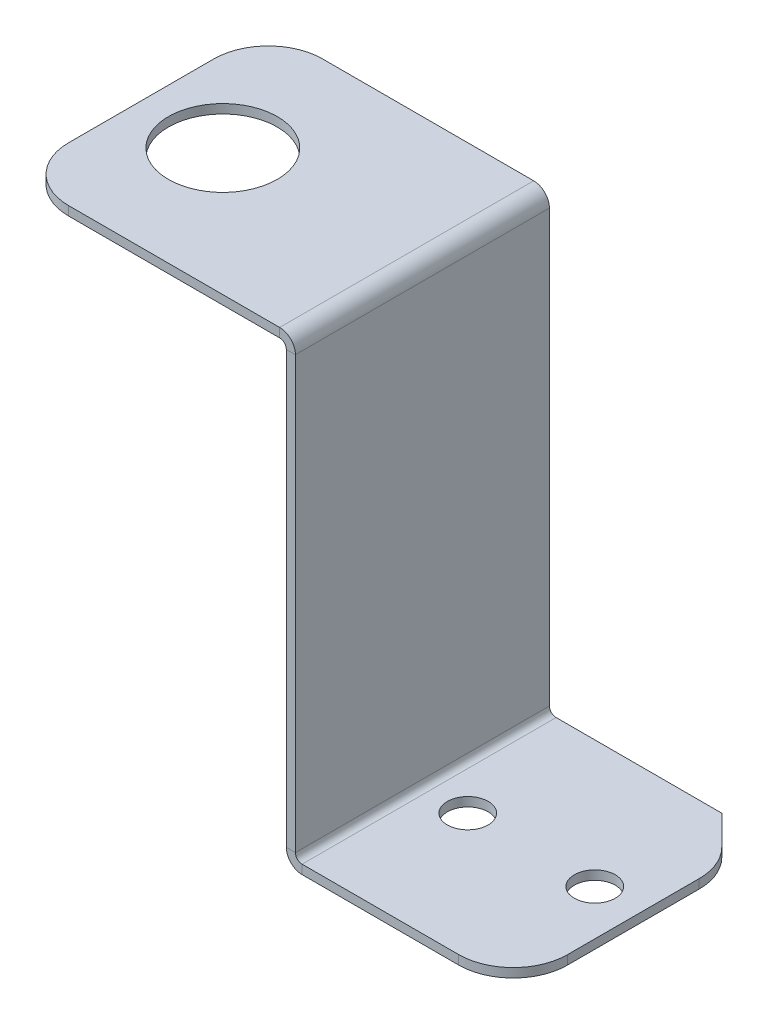
ISO-10303-21;
HEADER;
FILE_DESCRIPTION(('STEP AP214'),'2;1');
FILE_NAME('part.step','',(''),(''),'','','');
FILE_SCHEMA(('AUTOMOTIVE_DESIGN { 1 0 10303 214 1 1 1 1 }'));
ENDSEC;
DATA;
#1=APPLICATION_CONTEXT('core data for automotive mechanical design processes');
#2=APPLICATION_PROTOCOL_DEFINITION('international standard','automotive_design',2000,#1);
#3=PRODUCT_CONTEXT('',#1,'mechanical');
#4=PRODUCT('Part','Part','',(#3));
#5=PRODUCT_RELATED_PRODUCT_CATEGORY('part','',(#4));
#6=PRODUCT_DEFINITION_FORMATION('','',#4);
#7=PRODUCT_DEFINITION_CONTEXT('part definition',#1,'design');
#8=PRODUCT_DEFINITION('design','',#6,#7);
#9=PRODUCT_DEFINITION_SHAPE('','',#8);
#10=(LENGTH_UNIT() NAMED_UNIT(*) SI_UNIT(.MILLI.,.METRE.));
#11=(NAMED_UNIT(*) PLANE_ANGLE_UNIT() SI_UNIT($,.RADIAN.));
#12=(NAMED_UNIT(*) SI_UNIT($,.STERADIAN.) SOLID_ANGLE_UNIT());
#13=UNCERTAINTY_MEASURE_WITH_UNIT(LENGTH_MEASURE(1.E-05),#10,'distance_accuracy_value','');
#14=(GEOMETRIC_REPRESENTATION_CONTEXT(3) GLOBAL_UNCERTAINTY_ASSIGNED_CONTEXT((#13)) GLOBAL_UNIT_ASSIGNED_CONTEXT((#10,
#11,#12)) REPRESENTATION_CONTEXT('',''));
#15=CARTESIAN_POINT('',(0.,0.,0.));
#16=DIRECTION('',(0.,0.,1.));
#17=DIRECTION('',(1.,0.,0.));
#18=AXIS2_PLACEMENT_3D('',#15,#16,#17);
#19=CARTESIAN_POINT('',(-0.736600000000001,20.7619047619048,-28.));
#20=DIRECTION('',(0.,0.,-1.));
#21=DIRECTION('',(-1.,0.,0.));
#22=AXIS2_PLACEMENT_3D('',#19,#20,#21);
#23=PLANE('',#22);
#24=DIRECTION('',(0.,-1.,0.));
#25=VECTOR('',#24,1.);
#26=CARTESIAN_POINT('',(0.,19.7619047619048,-28.));
#27=LINE('',#26,#25);
#28=CARTESIAN_POINT('',(0.,19.0253047619048,-28.));
#29=VERTEX_POINT('',#28);
#30=CARTESIAN_POINT('',(0.,-28.5014952380952,-28.));
#31=VERTEX_POINT('',#30);
#32=EDGE_CURVE('E313',#29,#31,#27,.T.);
#33=ORIENTED_EDGE('',*,*,#32,.F.);
#34=DIRECTION('',(1.,0.,0.));
#35=VECTOR('',#34,1.);
#36=CARTESIAN_POINT('',(0.,19.0253047619048,-28.));
#37=LINE('',#36,#35);
#38=CARTESIAN_POINT('',(1.,19.0253047619048,-28.));
#39=VERTEX_POINT('',#38);
#40=EDGE_CURVE('E335',#29,#39,#37,.T.);
#41=ORIENTED_EDGE('',*,*,#40,.T.);
#42=DIRECTION('',(0.,-1.,0.));
#43=VECTOR('',#42,1.);
#44=CARTESIAN_POINT('',(1.,19.7619047619048,-28.));
#45=LINE('',#44,#43);
#46=CARTESIAN_POINT('',(1.00000000000001,-28.5014952380952,-28.));
#47=VERTEX_POINT('',#46);
#48=EDGE_CURVE('E310',#39,#47,#45,.T.);
#49=ORIENTED_EDGE('',*,*,#48,.T.);
#50=DIRECTION('',(-1.,0.,0.));
#51=VECTOR('',#50,1.);
#52=CARTESIAN_POINT('',(1.00000000000001,-28.5014952380952,-28.));
#53=LINE('',#52,#51);
#54=EDGE_CURVE('E329',#47,#31,#53,.T.);
#55=ORIENTED_EDGE('',*,*,#54,.T.);
#56=EDGE_LOOP('',(#33,#41,#49,#55));
#57=FACE_BOUND('',#56,.T.);
#58=ADVANCED_FACE('F39',(#57),#23,.T.);
#59=CARTESIAN_POINT('',(1.73660000000001,-29.2380952380952,0.));
#60=DIRECTION('',(0.,0.,1.));
#61=DIRECTION('',(1.,0.,0.));
#62=AXIS2_PLACEMENT_3D('',#59,#60,#61);
#63=PLANE('',#62);
#64=DIRECTION('',(0.,-1.,0.));
#65=VECTOR('',#64,1.);
#66=CARTESIAN_POINT('',(0.,19.7619047619048,0.));
#67=LINE('',#66,#65);
#68=CARTESIAN_POINT('',(0.,19.0253047619048,0.));
#69=VERTEX_POINT('',#68);
#70=CARTESIAN_POINT('',(0.,-28.5014952380952,0.));
#71=VERTEX_POINT('',#70);
#72=EDGE_CURVE('E314',#69,#71,#67,.T.);
#73=ORIENTED_EDGE('',*,*,#72,.T.);
#74=DIRECTION('',(1.,0.,0.));
#75=VECTOR('',#74,1.);
#76=CARTESIAN_POINT('',(0.,-28.5014952380952,0.));
#77=LINE('',#76,#75);
#78=CARTESIAN_POINT('',(1.00000000000001,-28.5014952380952,0.));
#79=VERTEX_POINT('',#78);
#80=EDGE_CURVE('E323',#71,#79,#77,.T.);
#81=ORIENTED_EDGE('',*,*,#80,.T.);
#82=DIRECTION('',(0.,-1.,0.));
#83=VECTOR('',#82,1.);
#84=CARTESIAN_POINT('',(1.,19.7619047619048,0.));
#85=LINE('',#84,#83);
#86=CARTESIAN_POINT('',(1.,19.0253047619048,0.));
#87=VERTEX_POINT('',#86);
#88=EDGE_CURVE('E306',#87,#79,#85,.T.);
#89=ORIENTED_EDGE('',*,*,#88,.F.);
#90=DIRECTION('',(-1.,0.,0.));
#91=VECTOR('',#90,1.);
#92=CARTESIAN_POINT('',(1.,19.0253047619048,0.));
#93=LINE('',#92,#91);
#94=EDGE_CURVE('E11',#87,#69,#93,.T.);
#95=ORIENTED_EDGE('',*,*,#94,.T.);
#96=EDGE_LOOP('',(#73,#81,#89,#95));
#97=FACE_BOUND('',#96,.T.);
#98=ADVANCED_FACE('F359',(#97),#63,.T.);
#99=CARTESIAN_POINT('',(0.,19.7619047619048,-28.));
#100=DIRECTION('',(-1.,0.,0.));
#101=DIRECTION('',(0.,-1.,0.));
#102=AXIS2_PLACEMENT_3D('',#99,#100,#101);
#103=PLANE('',#102);
#104=ORIENTED_EDGE('',*,*,#72,.F.);
#105=DIRECTION('',(0.,0.,1.));
#106=VECTOR('',#105,1.);
#107=CARTESIAN_POINT('',(0.,19.0253047619048,-28.));
#108=LINE('',#107,#106);
#109=EDGE_CURVE('E46',#29,#69,#108,.T.);
#110=ORIENTED_EDGE('',*,*,#109,.F.);
#111=ORIENTED_EDGE('',*,*,#32,.T.);
#112=DIRECTION('',(0.,0.,1.));
#113=VECTOR('',#112,1.);
#114=CARTESIAN_POINT('',(0.,-28.5014952380952,-28.));
#115=LINE('',#114,#113);
#116=EDGE_CURVE('E326',#31,#71,#115,.T.);
#117=ORIENTED_EDGE('',*,*,#116,.T.);
#118=EDGE_LOOP('',(#104,#110,#111,#117));
#119=FACE_BOUND('',#118,.T.);
#120=ADVANCED_FACE('F390',(#119),#103,.T.);
#121=CARTESIAN_POINT('',(1.,19.7619047619048,-28.));
#122=DIRECTION('',(-1.,0.,0.));
#123=DIRECTION('',(0.,-1.,0.));
#124=AXIS2_PLACEMENT_3D('',#121,#122,#123);
#125=PLANE('',#124);
#126=ORIENTED_EDGE('',*,*,#88,.T.);
#127=DIRECTION('',(0.,0.,1.));
#128=VECTOR('',#127,1.);
#129=CARTESIAN_POINT('',(1.00000000000001,-28.5014952380952,-28.));
#130=LINE('',#129,#128);
#131=EDGE_CURVE('E317',#47,#79,#130,.T.);
#132=ORIENTED_EDGE('',*,*,#131,.F.);
#133=ORIENTED_EDGE('',*,*,#48,.F.);
#134=DIRECTION('',(0.,0.,1.));
#135=VECTOR('',#134,1.);
#136=CARTESIAN_POINT('',(1.,19.0253047619048,-28.));
#137=LINE('',#136,#135);
#138=EDGE_CURVE('E332',#39,#87,#137,.T.);
#139=ORIENTED_EDGE('',*,*,#138,.T.);
#140=EDGE_LOOP('',(#126,#132,#133,#139));
#141=FACE_BOUND('',#140,.T.);
#142=ADVANCED_FACE('F361',(#141),#125,.F.);
#143=CARTESIAN_POINT('',(1.73660000000001,-28.5014952380952,-28.));
#144=DIRECTION('',(0.,0.,1.));
#145=DIRECTION('',(1.,0.,0.));
#146=AXIS2_PLACEMENT_3D('',#143,#144,#145);
#147=PLANE('',#146);
#148=DIRECTION('',(0.,1.,0.));
#149=VECTOR('',#148,1.);
#150=CARTESIAN_POINT('',(1.7366,-30.2380952380952,-28.));
#151=LINE('',#150,#149);
#152=CARTESIAN_POINT('',(1.7366,-30.2380952380952,-28.));
#153=VERTEX_POINT('',#152);
#154=CARTESIAN_POINT('',(1.7366,-29.2380952380952,-28.));
#155=VERTEX_POINT('',#154);
#156=EDGE_CURVE('E232',#153,#155,#151,.T.);
#157=ORIENTED_EDGE('',*,*,#156,.F.);
#158=CARTESIAN_POINT('',(1.73660000000001,-28.5014952380952,-28.));
#159=DIRECTION('',(0.,0.,-1.));
#160=DIRECTION('',(-1.,0.,0.));
#161=AXIS2_PLACEMENT_3D('',#158,#159,#160);
#162=CIRCLE('',#161,1.7366);
#163=EDGE_CURVE('E60',#153,#31,#162,.T.);
#164=ORIENTED_EDGE('',*,*,#163,.T.);
#165=ORIENTED_EDGE('',*,*,#54,.F.);
#166=CARTESIAN_POINT('',(1.73660000000001,-28.5014952380952,-28.));
#167=DIRECTION('',(0.,0.,-1.));
#168=DIRECTION('',(-1.,0.,0.));
#169=AXIS2_PLACEMENT_3D('',#166,#167,#168);
#170=CIRCLE('',#169,0.7366);
#171=EDGE_CURVE('E299',#155,#47,#170,.T.);
#172=ORIENTED_EDGE('',*,*,#171,.F.);
#173=EDGE_LOOP('',(#157,#164,#165,#172));
#174=FACE_BOUND('',#173,.T.);
#175=ADVANCED_FACE('F382',(#174),#147,.F.);
#176=CARTESIAN_POINT('',(1.73660000000001,-28.5014952380952,0.));
#177=DIRECTION('',(0.,0.,-1.));
#178=DIRECTION('',(0.,1.,0.));
#179=AXIS2_PLACEMENT_3D('',#176,#177,#178);
#180=PLANE('',#179);
#181=ORIENTED_EDGE('',*,*,#80,.F.);
#182=CARTESIAN_POINT('',(1.73660000000001,-28.5014952380952,0.));
#183=DIRECTION('',(0.,0.,-1.));
#184=DIRECTION('',(-1.,0.,0.));
#185=AXIS2_PLACEMENT_3D('',#182,#183,#184);
#186=CIRCLE('',#185,1.7366);
#187=CARTESIAN_POINT('',(1.7366,-30.2380952380952,0.));
#188=VERTEX_POINT('',#187);
#189=EDGE_CURVE('E303',#71,#188,#186,.F.);
#190=ORIENTED_EDGE('',*,*,#189,.T.);
#191=DIRECTION('',(0.,-1.,0.));
#192=VECTOR('',#191,1.);
#193=CARTESIAN_POINT('',(1.7366,-29.2380952380952,0.));
#194=LINE('',#193,#192);
#195=CARTESIAN_POINT('',(1.73660000000001,-29.2380952380952,0.));
#196=VERTEX_POINT('',#195);
#197=EDGE_CURVE('E254',#196,#188,#194,.T.);
#198=ORIENTED_EDGE('',*,*,#197,.F.);
#199=CARTESIAN_POINT('',(1.73660000000001,-28.5014952380952,0.));
#200=DIRECTION('',(0.,0.,1.));
#201=DIRECTION('',(0.,-1.,0.));
#202=AXIS2_PLACEMENT_3D('',#199,#200,#201);
#203=CIRCLE('',#202,0.7366);
#204=EDGE_CURVE('E302',#79,#196,#203,.T.);
#205=ORIENTED_EDGE('',*,*,#204,.F.);
#206=EDGE_LOOP('',(#181,#190,#198,#205));
#207=FACE_BOUND('',#206,.T.);
#208=ADVANCED_FACE('F369',(#207),#180,.F.);
#209=CARTESIAN_POINT('',(1.73660000000001,-28.5014952380952,14.0851045810561));
#210=DIRECTION('',(0.,0.,-1.));
#211=DIRECTION('',(-1.,0.,0.));
#212=AXIS2_PLACEMENT_3D('',#209,#210,#211);
#213=CYLINDRICAL_SURFACE('',#212,0.7366);
#214=ORIENTED_EDGE('',*,*,#204,.T.);
#215=DIRECTION('',(0.,0.,1.));
#216=VECTOR('',#215,1.);
#217=CARTESIAN_POINT('',(1.7366,-29.2380952380952,-28.));
#218=LINE('',#217,#216);
#219=EDGE_CURVE('E262',#155,#196,#218,.T.);
#220=ORIENTED_EDGE('',*,*,#219,.F.);
#221=ORIENTED_EDGE('',*,*,#171,.T.);
#222=ORIENTED_EDGE('',*,*,#131,.T.);
#223=EDGE_LOOP('',(#214,#220,#221,#222));
#224=FACE_BOUND('',#223,.T.);
#225=ADVANCED_FACE('F364',(#224),#213,.F.);
#226=CARTESIAN_POINT('',(1.73660000000001,-28.5014952380952,14.0851045810561));
#227=DIRECTION('',(0.,0.,-1.));
#228=DIRECTION('',(-1.,0.,0.));
#229=AXIS2_PLACEMENT_3D('',#226,#227,#228);
#230=CYLINDRICAL_SURFACE('',#229,1.7366);
#231=ORIENTED_EDGE('',*,*,#189,.F.);
#232=ORIENTED_EDGE('',*,*,#116,.F.);
#233=ORIENTED_EDGE('',*,*,#163,.F.);
#234=DIRECTION('',(0.,0.,1.));
#235=VECTOR('',#234,1.);
#236=CARTESIAN_POINT('',(1.7366,-30.2380952380952,-28.));
#237=LINE('',#236,#235);
#238=EDGE_CURVE('E227',#153,#188,#237,.T.);
#239=ORIENTED_EDGE('',*,*,#238,.T.);
#240=EDGE_LOOP('',(#231,#232,#233,#239));
#241=FACE_BOUND('',#240,.T.);
#242=ADVANCED_FACE('F404',(#241),#230,.T.);
#243=CARTESIAN_POINT('',(20.,-28.5014952380952,-28.));
#244=DIRECTION('',(0.707106781186549,0.,-0.707106781186547));
#245=DIRECTION('',(0.,1.,0.));
#246=AXIS2_PLACEMENT_3D('',#243,#244,#245);
#247=PLANE('',#246);
#248=DIRECTION('',(-0.707106781186547,0.,-0.707106781186549));
#249=VECTOR('',#248,1.);
#250=CARTESIAN_POINT('',(20.,-29.2380952380952,-28.));
#251=LINE('',#250,#249);
#252=CARTESIAN_POINT('',(23.2426406871193,-29.2380952380952,-24.7573593128807));
#253=VERTEX_POINT('',#252);
#254=CARTESIAN_POINT('',(20.,-29.2380952380952,-28.));
#255=VERTEX_POINT('',#254);
#256=EDGE_CURVE('E265',#253,#255,#251,.T.);
#257=ORIENTED_EDGE('',*,*,#256,.F.);
#258=DIRECTION('',(0.,1.,0.));
#259=VECTOR('',#258,1.);
#260=CARTESIAN_POINT('',(23.2426406871193,-30.2380952380952,-24.7573593128807));
#261=LINE('',#260,#259);
#262=CARTESIAN_POINT('',(23.2426406871193,-30.2380952380952,-24.7573593128807));
#263=VERTEX_POINT('',#262);
#264=EDGE_CURVE('E295',#253,#263,#261,.F.);
#265=ORIENTED_EDGE('',*,*,#264,.T.);
#266=DIRECTION('',(0.707106781186547,0.,0.707106781186549));
#267=VECTOR('',#266,1.);
#268=CARTESIAN_POINT('',(10.,-30.2380952380952,-38.));
#269=LINE('',#268,#267);
#270=CARTESIAN_POINT('',(20.,-30.2380952380952,-28.));
#271=VERTEX_POINT('',#270);
#272=EDGE_CURVE('E243',#271,#263,#269,.T.);
#273=ORIENTED_EDGE('',*,*,#272,.F.);
#274=DIRECTION('',(0.,-1.,0.));
#275=VECTOR('',#274,1.);
#276=CARTESIAN_POINT('',(20.,-30.2380952380952,-28.));
#277=LINE('',#276,#275);
#278=EDGE_CURVE('E235',#255,#271,#277,.T.);
#279=ORIENTED_EDGE('',*,*,#278,.F.);
#280=EDGE_LOOP('',(#257,#265,#273,#279));
#281=FACE_BOUND('',#280,.T.);
#282=ADVANCED_FACE('F418',(#281),#247,.T.);
#283=CARTESIAN_POINT('',(19.,-29.2380952380952,-20.5147186257614));
#284=DIRECTION('',(0.,-1.,0.));
#285=DIRECTION('',(0.,0.,-1.));
#286=AXIS2_PLACEMENT_3D('',#283,#284,#285);
#287=CYLINDRICAL_SURFACE('',#286,6.);
#288=CARTESIAN_POINT('',(19.,-30.2380952380952,-20.5147186257614));
#289=DIRECTION('',(0.,-1.,0.));
#290=DIRECTION('',(0.,0.,-1.));
#291=AXIS2_PLACEMENT_3D('',#288,#289,#290);
#292=CIRCLE('',#291,6.);
#293=CARTESIAN_POINT('',(25.,-30.2380952380952,-20.5147186257614));
#294=VERTEX_POINT('',#293);
#295=EDGE_CURVE('E241',#263,#294,#292,.T.);
#296=ORIENTED_EDGE('',*,*,#295,.F.);
#297=ORIENTED_EDGE('',*,*,#264,.F.);
#298=CARTESIAN_POINT('',(19.,-29.2380952380952,-20.5147186257614));
#299=DIRECTION('',(0.,-1.,0.));
#300=DIRECTION('',(0.,0.,-1.));
#301=AXIS2_PLACEMENT_3D('',#298,#299,#300);
#302=CIRCLE('',#301,6.);
#303=CARTESIAN_POINT('',(25.,-29.2380952380952,-20.5147186257614));
#304=VERTEX_POINT('',#303);
#305=EDGE_CURVE('E267',#304,#253,#302,.F.);
#306=ORIENTED_EDGE('',*,*,#305,.F.);
#307=DIRECTION('',(0.,1.,0.));
#308=VECTOR('',#307,1.);
#309=CARTESIAN_POINT('',(25.,-29.2380952380952,-20.5147186257614));
#310=LINE('',#309,#308);
#311=EDGE_CURVE('E286',#294,#304,#310,.T.);
#312=ORIENTED_EDGE('',*,*,#311,.F.);
#313=EDGE_LOOP('',(#296,#297,#306,#312));
#314=FACE_BOUND('',#313,.T.);
#315=ADVANCED_FACE('F420',(#314),#287,.T.);
#316=CARTESIAN_POINT('',(25.,-29.2380952380952,-28.));
#317=DIRECTION('',(-1.,0.,0.));
#318=DIRECTION('',(0.,0.,1.));
#319=AXIS2_PLACEMENT_3D('',#316,#317,#318);
#320=PLANE('',#319);
#321=DIRECTION('',(0.,0.,1.));
#322=VECTOR('',#321,1.);
#323=CARTESIAN_POINT('',(25.,-29.2380952380952,-28.));
#324=LINE('',#323,#322);
#325=CARTESIAN_POINT('',(25.,-29.2380952380952,-6.));
#326=VERTEX_POINT('',#325);
#327=EDGE_CURVE('E292',#304,#326,#324,.T.);
#328=ORIENTED_EDGE('',*,*,#327,.T.);
#329=DIRECTION('',(0.,-1.,0.));
#330=VECTOR('',#329,1.);
#331=CARTESIAN_POINT('',(25.,-30.2380952380952,-6.));
#332=LINE('',#331,#330);
#333=CARTESIAN_POINT('',(25.,-30.2380952380952,-6.));
#334=VERTEX_POINT('',#333);
#335=EDGE_CURVE('E289',#326,#334,#332,.T.);
#336=ORIENTED_EDGE('',*,*,#335,.T.);
#337=DIRECTION('',(0.,0.,1.));
#338=VECTOR('',#337,1.);
#339=CARTESIAN_POINT('',(25.,-30.2380952380952,-28.));
#340=LINE('',#339,#338);
#341=EDGE_CURVE('E251',#294,#334,#340,.T.);
#342=ORIENTED_EDGE('',*,*,#341,.F.);
#343=ORIENTED_EDGE('',*,*,#311,.T.);
#344=EDGE_LOOP('',(#328,#336,#342,#343));
#345=FACE_BOUND('',#344,.T.);
#346=ADVANCED_FACE('F412',(#345),#320,.F.);
#347=CARTESIAN_POINT('',(19.,-29.2380952380952,-6.));
#348=DIRECTION('',(0.,1.,0.));
#349=DIRECTION('',(0.,0.,1.));
#350=AXIS2_PLACEMENT_3D('',#347,#348,#349);
#351=CYLINDRICAL_SURFACE('',#350,6.);
#352=CARTESIAN_POINT('',(19.,-29.2380952380952,-6.));
#353=DIRECTION('',(0.,-1.,0.));
#354=DIRECTION('',(0.,0.,-1.));
#355=AXIS2_PLACEMENT_3D('',#352,#353,#354);
#356=CIRCLE('',#355,6.);
#357=CARTESIAN_POINT('',(19.,-29.2380952380952,0.));
#358=VERTEX_POINT('',#357);
#359=EDGE_CURVE('E269',#358,#326,#356,.F.);
#360=ORIENTED_EDGE('',*,*,#359,.F.);
#361=DIRECTION('',(0.,-1.,0.));
#362=VECTOR('',#361,1.);
#363=CARTESIAN_POINT('',(19.,-29.2380952380952,0.));
#364=LINE('',#363,#362);
#365=CARTESIAN_POINT('',(19.,-30.2380952380952,0.));
#366=VERTEX_POINT('',#365);
#367=EDGE_CURVE('E257',#366,#358,#364,.F.);
#368=ORIENTED_EDGE('',*,*,#367,.F.);
#369=CARTESIAN_POINT('',(19.,-30.2380952380952,-6.));
#370=DIRECTION('',(0.,-1.,0.));
#371=DIRECTION('',(0.,0.,-1.));
#372=AXIS2_PLACEMENT_3D('',#369,#370,#371);
#373=CIRCLE('',#372,6.);
#374=EDGE_CURVE('E249',#334,#366,#373,.T.);
#375=ORIENTED_EDGE('',*,*,#374,.F.);
#376=ORIENTED_EDGE('',*,*,#335,.F.);
#377=EDGE_LOOP('',(#360,#368,#375,#376));
#378=FACE_BOUND('',#377,.T.);
#379=ADVANCED_FACE('F410',(#378),#351,.T.);
#380=CARTESIAN_POINT('',(6.00000000000001,-30.2380952380952,-14.));
#381=DIRECTION('',(0.,-1.,0.));
#382=DIRECTION('',(0.,0.,-1.));
#383=AXIS2_PLACEMENT_3D('',#380,#381,#382);
#384=CYLINDRICAL_SURFACE('',#383,2.25);
#385=CARTESIAN_POINT('',(6.00000000000001,-30.2380952380952,-14.));
#386=DIRECTION('',(0.,-1.,0.));
#387=DIRECTION('',(0.,0.,-1.));
#388=AXIS2_PLACEMENT_3D('',#385,#386,#387);
#389=CIRCLE('',#388,2.25);
#390=CARTESIAN_POINT('',(6.00000000000001,-30.2380952380952,-16.25));
#391=VERTEX_POINT('',#390);
#392=EDGE_CURVE('E283',#391,#391,#389,.T.);
#393=ORIENTED_EDGE('',*,*,#392,.T.);
#394=EDGE_LOOP('',(#393));
#395=FACE_BOUND('',#394,.T.);
#396=CARTESIAN_POINT('',(6.00000000000001,-29.2380952380952,-14.));
#397=DIRECTION('',(0.,-1.,0.));
#398=DIRECTION('',(0.,0.,-1.));
#399=AXIS2_PLACEMENT_3D('',#396,#397,#398);
#400=CIRCLE('',#399,2.25);
#401=CARTESIAN_POINT('',(6.00000000000001,-29.2380952380952,-16.25));
#402=VERTEX_POINT('',#401);
#403=EDGE_CURVE('E274',#402,#402,#400,.T.);
#404=ORIENTED_EDGE('',*,*,#403,.F.);
#405=EDGE_LOOP('',(#404));
#406=FACE_BOUND('',#405,.T.);
#407=ADVANCED_FACE('F433',(#395,#406),#384,.F.);
#408=CARTESIAN_POINT('',(20.,-30.2380952380952,-14.));
#409=DIRECTION('',(0.,-1.,0.));
#410=DIRECTION('',(0.,0.,-1.));
#411=AXIS2_PLACEMENT_3D('',#408,#409,#410);
#412=CYLINDRICAL_SURFACE('',#411,2.25);
#413=CARTESIAN_POINT('',(20.,-30.2380952380952,-14.));
#414=DIRECTION('',(0.,-1.,0.));
#415=DIRECTION('',(0.,0.,-1.));
#416=AXIS2_PLACEMENT_3D('',#413,#414,#415);
#417=CIRCLE('',#416,2.25);
#418=CARTESIAN_POINT('',(20.,-30.2380952380952,-16.25));
#419=VERTEX_POINT('',#418);
#420=EDGE_CURVE('E280',#419,#419,#417,.T.);
#421=ORIENTED_EDGE('',*,*,#420,.T.);
#422=EDGE_LOOP('',(#421));
#423=FACE_BOUND('',#422,.T.);
#424=CARTESIAN_POINT('',(20.,-29.2380952380952,-14.));
#425=DIRECTION('',(0.,-1.,0.));
#426=DIRECTION('',(0.,0.,-1.));
#427=AXIS2_PLACEMENT_3D('',#424,#425,#426);
#428=CIRCLE('',#427,2.25);
#429=CARTESIAN_POINT('',(20.,-29.2380952380952,-16.25));
#430=VERTEX_POINT('',#429);
#431=EDGE_CURVE('E277',#430,#430,#428,.T.);
#432=ORIENTED_EDGE('',*,*,#431,.F.);
#433=EDGE_LOOP('',(#432));
#434=FACE_BOUND('',#433,.T.);
#435=ADVANCED_FACE('F436',(#423,#434),#412,.F.);
#436=CARTESIAN_POINT('',(0.,-29.2380952380952,-28.));
#437=DIRECTION('',(0.,-1.,0.));
#438=DIRECTION('',(0.,0.,-1.));
#439=AXIS2_PLACEMENT_3D('',#436,#437,#438);
#440=PLANE('',#439);
#441=ORIENTED_EDGE('',*,*,#431,.T.);
#442=EDGE_LOOP('',(#441));
#443=FACE_BOUND('',#442,.T.);
#444=ORIENTED_EDGE('',*,*,#403,.T.);
#445=EDGE_LOOP('',(#444));
#446=FACE_BOUND('',#445,.T.);
#447=DIRECTION('',(1.,0.,0.));
#448=VECTOR('',#447,1.);
#449=CARTESIAN_POINT('',(0.,-29.2380952380952,0.));
#450=LINE('',#449,#448);
#451=EDGE_CURVE('E271',#196,#358,#450,.T.);
#452=ORIENTED_EDGE('',*,*,#451,.T.);
#453=ORIENTED_EDGE('',*,*,#359,.T.);
#454=ORIENTED_EDGE('',*,*,#327,.F.);
#455=ORIENTED_EDGE('',*,*,#305,.T.);
#456=ORIENTED_EDGE('',*,*,#256,.T.);
#457=DIRECTION('',(1.,0.,0.));
#458=VECTOR('',#457,1.);
#459=CARTESIAN_POINT('',(0.,-29.2380952380952,-28.));
#460=LINE('',#459,#458);
#461=EDGE_CURVE('E238',#155,#255,#460,.T.);
#462=ORIENTED_EDGE('',*,*,#461,.F.);
#463=ORIENTED_EDGE('',*,*,#219,.T.);
#464=EDGE_LOOP('',(#452,#453,#454,#455,#456,#462,#463));
#465=FACE_BOUND('',#464,.T.);
#466=ADVANCED_FACE('F376',(#443,#446,#465),#440,.F.);
#467=CARTESIAN_POINT('',(1.7366,-28.5014952380952,0.));
#468=DIRECTION('',(0.,0.,1.));
#469=DIRECTION('',(1.,0.,0.));
#470=AXIS2_PLACEMENT_3D('',#467,#468,#469);
#471=PLANE('',#470);
#472=DIRECTION('',(1.,0.,0.));
#473=VECTOR('',#472,1.);
#474=CARTESIAN_POINT('',(0.,-30.2380952380952,0.));
#475=LINE('',#474,#473);
#476=EDGE_CURVE('E259',#188,#366,#475,.T.);
#477=ORIENTED_EDGE('',*,*,#476,.T.);
#478=ORIENTED_EDGE('',*,*,#367,.T.);
#479=ORIENTED_EDGE('',*,*,#451,.F.);
#480=ORIENTED_EDGE('',*,*,#197,.T.);
#481=EDGE_LOOP('',(#477,#478,#479,#480));
#482=FACE_BOUND('',#481,.T.);
#483=ADVANCED_FACE('F372',(#482),#471,.T.);
#484=CARTESIAN_POINT('',(0.,-30.2380952380952,-28.));
#485=DIRECTION('',(0.,-1.,0.));
#486=DIRECTION('',(0.,0.,-1.));
#487=AXIS2_PLACEMENT_3D('',#484,#485,#486);
#488=PLANE('',#487);
#489=ORIENTED_EDGE('',*,*,#420,.F.);
#490=EDGE_LOOP('',(#489));
#491=FACE_BOUND('',#490,.T.);
#492=ORIENTED_EDGE('',*,*,#392,.F.);
#493=EDGE_LOOP('',(#492));
#494=FACE_BOUND('',#493,.T.);
#495=ORIENTED_EDGE('',*,*,#341,.T.);
#496=ORIENTED_EDGE('',*,*,#374,.T.);
#497=ORIENTED_EDGE('',*,*,#476,.F.);
#498=ORIENTED_EDGE('',*,*,#238,.F.);
#499=DIRECTION('',(1.,0.,0.));
#500=VECTOR('',#499,1.);
#501=CARTESIAN_POINT('',(0.,-30.2380952380952,-28.));
#502=LINE('',#501,#500);
#503=EDGE_CURVE('E246',#153,#271,#502,.T.);
#504=ORIENTED_EDGE('',*,*,#503,.T.);
#505=ORIENTED_EDGE('',*,*,#272,.T.);
#506=ORIENTED_EDGE('',*,*,#295,.T.);
#507=EDGE_LOOP('',(#495,#496,#497,#498,#504,#505,#506));
#508=FACE_BOUND('',#507,.T.);
#509=ADVANCED_FACE('F406',(#491,#494,#508),#488,.T.);
#510=CARTESIAN_POINT('',(1.,-28.5014952380952,-28.));
#511=DIRECTION('',(0.,0.,-1.));
#512=DIRECTION('',(-1.,0.,0.));
#513=AXIS2_PLACEMENT_3D('',#510,#511,#512);
#514=PLANE('',#513);
#515=ORIENTED_EDGE('',*,*,#461,.T.);
#516=ORIENTED_EDGE('',*,*,#278,.T.);
#517=ORIENTED_EDGE('',*,*,#503,.F.);
#518=ORIENTED_EDGE('',*,*,#156,.T.);
#519=EDGE_LOOP('',(#515,#516,#517,#518));
#520=FACE_BOUND('',#519,.T.);
#521=ADVANCED_FACE('F380',(#520),#514,.T.);
#522=CARTESIAN_POINT('',(-0.7366,19.0253047619048,-28.));
#523=DIRECTION('',(0.,0.,-1.));
#524=DIRECTION('',(-1.,0.,0.));
#525=AXIS2_PLACEMENT_3D('',#522,#523,#524);
#526=PLANE('',#525);
#527=ORIENTED_EDGE('',*,*,#40,.F.);
#528=CARTESIAN_POINT('',(-0.7366,19.0253047619048,-28.));
#529=DIRECTION('',(0.,0.,1.));
#530=DIRECTION('',(1.,0.,0.));
#531=AXIS2_PLACEMENT_3D('',#528,#529,#530);
#532=CIRCLE('',#531,0.7366);
#533=CARTESIAN_POINT('',(-0.7366,19.7619047619048,-28.));
#534=VERTEX_POINT('',#533);
#535=EDGE_CURVE('E229',#29,#534,#532,.T.);
#536=ORIENTED_EDGE('',*,*,#535,.T.);
#537=DIRECTION('',(0.,-1.,0.));
#538=VECTOR('',#537,1.);
#539=CARTESIAN_POINT('',(-0.7366,20.7619047619048,-28.));
#540=LINE('',#539,#538);
#541=CARTESIAN_POINT('',(-0.736600000000004,20.7619047619048,-28.));
#542=VERTEX_POINT('',#541);
#543=EDGE_CURVE('E189',#542,#534,#540,.T.);
#544=ORIENTED_EDGE('',*,*,#543,.F.);
#545=CARTESIAN_POINT('',(-0.7366,19.0253047619048,-28.));
#546=DIRECTION('',(0.,0.,1.));
#547=DIRECTION('',(1.,0.,0.));
#548=AXIS2_PLACEMENT_3D('',#545,#546,#547);
#549=CIRCLE('',#548,1.7366);
#550=EDGE_CURVE('E220',#39,#542,#549,.T.);
#551=ORIENTED_EDGE('',*,*,#550,.F.);
#552=EDGE_LOOP('',(#527,#536,#544,#551));
#553=FACE_BOUND('',#552,.T.);
#554=ADVANCED_FACE('F342',(#553),#526,.T.);
#555=CARTESIAN_POINT('',(-0.7366,19.0253047619048,0.));
#556=DIRECTION('',(0.,0.,1.));
#557=DIRECTION('',(1.,0.,0.));
#558=AXIS2_PLACEMENT_3D('',#555,#556,#557);
#559=PLANE('',#558);
#560=DIRECTION('',(0.,1.,0.));
#561=VECTOR('',#560,1.);
#562=CARTESIAN_POINT('',(-0.7366,19.7619047619048,0.));
#563=LINE('',#562,#561);
#564=CARTESIAN_POINT('',(-0.7366,19.7619047619048,0.));
#565=VERTEX_POINT('',#564);
#566=CARTESIAN_POINT('',(-0.736600000000002,20.7619047619048,0.));
#567=VERTEX_POINT('',#566);
#568=EDGE_CURVE('E177',#565,#567,#563,.T.);
#569=ORIENTED_EDGE('',*,*,#568,.F.);
#570=CARTESIAN_POINT('',(-0.7366,19.0253047619048,0.));
#571=DIRECTION('',(0.,0.,1.));
#572=DIRECTION('',(1.,0.,0.));
#573=AXIS2_PLACEMENT_3D('',#570,#571,#572);
#574=CIRCLE('',#573,0.7366);
#575=EDGE_CURVE('E224',#565,#69,#574,.F.);
#576=ORIENTED_EDGE('',*,*,#575,.T.);
#577=ORIENTED_EDGE('',*,*,#94,.F.);
#578=CARTESIAN_POINT('',(-0.7366,19.0253047619048,0.));
#579=DIRECTION('',(0.,0.,-1.));
#580=DIRECTION('',(-1.,0.,0.));
#581=AXIS2_PLACEMENT_3D('',#578,#579,#580);
#582=CIRCLE('',#581,1.7366);
#583=EDGE_CURVE('E223',#567,#87,#582,.T.);
#584=ORIENTED_EDGE('',*,*,#583,.F.);
#585=EDGE_LOOP('',(#569,#576,#577,#584));
#586=FACE_BOUND('',#585,.T.);
#587=ADVANCED_FACE('F355',(#586),#559,.T.);
#588=CARTESIAN_POINT('',(-0.7366,19.0253047619048,-42.0851045810561));
#589=DIRECTION('',(0.,0.,1.));
#590=DIRECTION('',(1.,0.,0.));
#591=AXIS2_PLACEMENT_3D('',#588,#589,#590);
#592=CYLINDRICAL_SURFACE('',#591,1.7366);
#593=ORIENTED_EDGE('',*,*,#583,.T.);
#594=ORIENTED_EDGE('',*,*,#138,.F.);
#595=ORIENTED_EDGE('',*,*,#550,.T.);
#596=DIRECTION('',(0.,0.,1.));
#597=VECTOR('',#596,1.);
#598=CARTESIAN_POINT('',(-0.7366,20.7619047619048,-28.));
#599=LINE('',#598,#597);
#600=EDGE_CURVE('E217',#542,#567,#599,.T.);
#601=ORIENTED_EDGE('',*,*,#600,.T.);
#602=EDGE_LOOP('',(#593,#594,#595,#601));
#603=FACE_BOUND('',#602,.T.);
#604=ADVANCED_FACE('F354',(#603),#592,.T.);
#605=CARTESIAN_POINT('',(-0.7366,19.0253047619048,-42.0851045810561));
#606=DIRECTION('',(0.,0.,1.));
#607=DIRECTION('',(1.,0.,0.));
#608=AXIS2_PLACEMENT_3D('',#605,#606,#607);
#609=CYLINDRICAL_SURFACE('',#608,0.7366);
#610=ORIENTED_EDGE('',*,*,#575,.F.);
#611=DIRECTION('',(0.,0.,1.));
#612=VECTOR('',#611,1.);
#613=CARTESIAN_POINT('',(-0.7366,19.7619047619048,-28.));
#614=LINE('',#613,#612);
#615=EDGE_CURVE('E168',#534,#565,#614,.T.);
#616=ORIENTED_EDGE('',*,*,#615,.F.);
#617=ORIENTED_EDGE('',*,*,#535,.F.);
#618=ORIENTED_EDGE('',*,*,#109,.T.);
#619=EDGE_LOOP('',(#610,#616,#617,#618));
#620=FACE_BOUND('',#619,.T.);
#621=ADVANCED_FACE('F345',(#620),#609,.F.);
#622=CARTESIAN_POINT('',(-24.,-28.5014952380952,-22.));
#623=DIRECTION('',(0.,1.,0.));
#624=DIRECTION('',(0.,0.,1.));
#625=AXIS2_PLACEMENT_3D('',#622,#623,#624);
#626=CYLINDRICAL_SURFACE('',#625,6.);
#627=CARTESIAN_POINT('',(-24.,19.7619047619048,-22.));
#628=DIRECTION('',(0.,-1.,0.));
#629=DIRECTION('',(1.,0.,0.));
#630=AXIS2_PLACEMENT_3D('',#627,#628,#629);
#631=CIRCLE('',#630,6.);
#632=CARTESIAN_POINT('',(-30.,19.7619047619048,-22.));
#633=VERTEX_POINT('',#632);
#634=CARTESIAN_POINT('',(-24.,19.7619047619048,-28.));
#635=VERTEX_POINT('',#634);
#636=EDGE_CURVE('E183',#633,#635,#631,.T.);
#637=ORIENTED_EDGE('',*,*,#636,.F.);
#638=DIRECTION('',(0.,1.,0.));
#639=VECTOR('',#638,1.);
#640=CARTESIAN_POINT('',(-30.,19.7619047619048,-22.));
#641=LINE('',#640,#639);
#642=CARTESIAN_POINT('',(-30.,20.7619047619048,-22.));
#643=VERTEX_POINT('',#642);
#644=EDGE_CURVE('E212',#643,#633,#641,.F.);
#645=ORIENTED_EDGE('',*,*,#644,.F.);
#646=CARTESIAN_POINT('',(-24.,20.7619047619048,-22.));
#647=DIRECTION('',(0.,-1.,0.));
#648=DIRECTION('',(1.,0.,0.));
#649=AXIS2_PLACEMENT_3D('',#646,#647,#648);
#650=CIRCLE('',#649,6.);
#651=CARTESIAN_POINT('',(-24.,20.7619047619048,-28.));
#652=VERTEX_POINT('',#651);
#653=EDGE_CURVE('E201',#652,#643,#650,.F.);
#654=ORIENTED_EDGE('',*,*,#653,.F.);
#655=DIRECTION('',(0.,1.,0.));
#656=VECTOR('',#655,1.);
#657=CARTESIAN_POINT('',(-24.,-28.5014952380952,-28.));
#658=LINE('',#657,#656);
#659=EDGE_CURVE('E198',#635,#652,#658,.T.);
#660=ORIENTED_EDGE('',*,*,#659,.F.);
#661=EDGE_LOOP('',(#637,#645,#654,#660));
#662=FACE_BOUND('',#661,.T.);
#663=ADVANCED_FACE('F552',(#662),#626,.T.);
#664=CARTESIAN_POINT('',(-24.,19.7619047619048,-6.));
#665=DIRECTION('',(0.,-1.,0.));
#666=DIRECTION('',(0.,0.,-1.));
#667=AXIS2_PLACEMENT_3D('',#664,#665,#666);
#668=CYLINDRICAL_SURFACE('',#667,6.);
#669=CARTESIAN_POINT('',(-24.,19.7619047619048,-6.));
#670=DIRECTION('',(0.,-1.,0.));
#671=DIRECTION('',(1.,0.,0.));
#672=AXIS2_PLACEMENT_3D('',#669,#670,#671);
#673=CIRCLE('',#672,6.);
#674=CARTESIAN_POINT('',(-24.,19.7619047619048,0.));
#675=VERTEX_POINT('',#674);
#676=CARTESIAN_POINT('',(-30.,19.7619047619048,-6.));
#677=VERTEX_POINT('',#676);
#678=EDGE_CURVE('E173',#675,#677,#673,.T.);
#679=ORIENTED_EDGE('',*,*,#678,.F.);
#680=DIRECTION('',(0.,1.,0.));
#681=VECTOR('',#680,1.);
#682=CARTESIAN_POINT('',(-24.,19.7619047619048,0.));
#683=LINE('',#682,#681);
#684=CARTESIAN_POINT('',(-24.,20.7619047619048,0.));
#685=VERTEX_POINT('',#684);
#686=EDGE_CURVE('E159',#685,#675,#683,.F.);
#687=ORIENTED_EDGE('',*,*,#686,.F.);
#688=CARTESIAN_POINT('',(-24.,20.7619047619048,-6.));
#689=DIRECTION('',(0.,-1.,0.));
#690=DIRECTION('',(1.,0.,0.));
#691=AXIS2_PLACEMENT_3D('',#688,#689,#690);
#692=CIRCLE('',#691,6.);
#693=CARTESIAN_POINT('',(-30.,20.7619047619048,-6.));
#694=VERTEX_POINT('',#693);
#695=EDGE_CURVE('E204',#694,#685,#692,.F.);
#696=ORIENTED_EDGE('',*,*,#695,.F.);
#697=DIRECTION('',(0.,1.,0.));
#698=VECTOR('',#697,1.);
#699=CARTESIAN_POINT('',(-30.,20.7619047619048,-6.));
#700=LINE('',#699,#698);
#701=EDGE_CURVE('E182',#677,#694,#700,.T.);
#702=ORIENTED_EDGE('',*,*,#701,.F.);
#703=EDGE_LOOP('',(#679,#687,#696,#702));
#704=FACE_BOUND('',#703,.T.);
#705=ADVANCED_FACE('F180',(#704),#668,.T.);
#706=CARTESIAN_POINT('',(-30.,19.7619047619048,-28.));
#707=DIRECTION('',(1.,0.,0.));
#708=DIRECTION('',(0.,0.,-1.));
#709=AXIS2_PLACEMENT_3D('',#706,#707,#708);
#710=PLANE('',#709);
#711=DIRECTION('',(0.,0.,1.));
#712=VECTOR('',#711,1.);
#713=CARTESIAN_POINT('',(-30.,19.7619047619048,-28.));
#714=LINE('',#713,#712);
#715=EDGE_CURVE('E215',#633,#677,#714,.T.);
#716=ORIENTED_EDGE('',*,*,#715,.T.);
#717=ORIENTED_EDGE('',*,*,#701,.T.);
#718=DIRECTION('',(0.,0.,1.));
#719=VECTOR('',#718,1.);
#720=CARTESIAN_POINT('',(-30.,20.7619047619048,-28.));
#721=LINE('',#720,#719);
#722=EDGE_CURVE('E206',#643,#694,#721,.T.);
#723=ORIENTED_EDGE('',*,*,#722,.F.);
#724=ORIENTED_EDGE('',*,*,#644,.T.);
#725=EDGE_LOOP('',(#716,#717,#723,#724));
#726=FACE_BOUND('',#725,.T.);
#727=ADVANCED_FACE('F571',(#726),#710,.F.);
#728=CARTESIAN_POINT('',(-21.,29.7619047619048,-14.));
#729=DIRECTION('',(0.,-1.,0.));
#730=DIRECTION('',(1.,0.,0.));
#731=AXIS2_PLACEMENT_3D('',#728,#729,#730);
#732=CYLINDRICAL_SURFACE('',#731,6.);
#733=CARTESIAN_POINT('',(-21.,19.7619047619048,-14.));
#734=DIRECTION('',(0.,1.,0.));
#735=DIRECTION('',(-1.,0.,0.));
#736=AXIS2_PLACEMENT_3D('',#733,#734,#735);
#737=CIRCLE('',#736,6.);
#738=CARTESIAN_POINT('',(-27.,19.7619047619048,-14.));
#739=VERTEX_POINT('',#738);
#740=EDGE_CURVE('E184',#739,#739,#737,.T.);
#741=ORIENTED_EDGE('',*,*,#740,.F.);
#742=EDGE_LOOP('',(#741));
#743=FACE_BOUND('',#742,.T.);
#744=CARTESIAN_POINT('',(-21.,20.7619047619048,-14.));
#745=DIRECTION('',(0.,-1.,0.));
#746=DIRECTION('',(1.,0.,0.));
#747=AXIS2_PLACEMENT_3D('',#744,#745,#746);
#748=CIRCLE('',#747,6.);
#749=CARTESIAN_POINT('',(-15.,20.7619047619048,-14.));
#750=VERTEX_POINT('',#749);
#751=EDGE_CURVE('E209',#750,#750,#748,.F.);
#752=ORIENTED_EDGE('',*,*,#751,.T.);
#753=EDGE_LOOP('',(#752));
#754=FACE_BOUND('',#753,.T.);
#755=ADVANCED_FACE('F580',(#743,#754),#732,.F.);
#756=CARTESIAN_POINT('',(0.,20.7619047619048,-28.));
#757=DIRECTION('',(0.,-1.,0.));
#758=DIRECTION('',(1.,0.,0.));
#759=AXIS2_PLACEMENT_3D('',#756,#757,#758);
#760=PLANE('',#759);
#761=ORIENTED_EDGE('',*,*,#751,.F.);
#762=EDGE_LOOP('',(#761));
#763=FACE_BOUND('',#762,.T.);
#764=ORIENTED_EDGE('',*,*,#722,.T.);
#765=ORIENTED_EDGE('',*,*,#695,.T.);
#766=DIRECTION('',(1.,0.,0.));
#767=VECTOR('',#766,1.);
#768=CARTESIAN_POINT('',(0.,20.7619047619048,0.));
#769=LINE('',#768,#767);
#770=EDGE_CURVE('E165',#685,#567,#769,.T.);
#771=ORIENTED_EDGE('',*,*,#770,.T.);
#772=ORIENTED_EDGE('',*,*,#600,.F.);
#773=DIRECTION('',(1.,0.,0.));
#774=VECTOR('',#773,1.);
#775=CARTESIAN_POINT('',(0.,20.7619047619048,-28.));
#776=LINE('',#775,#774);
#777=EDGE_CURVE('E195',#652,#542,#776,.T.);
#778=ORIENTED_EDGE('',*,*,#777,.F.);
#779=ORIENTED_EDGE('',*,*,#653,.T.);
#780=EDGE_LOOP('',(#764,#765,#771,#772,#778,#779));
#781=FACE_BOUND('',#780,.T.);
#782=ADVANCED_FACE('F351',(#763,#781),#760,.F.);
#783=CARTESIAN_POINT('',(1.7366,-28.5014952380952,-28.));
#784=DIRECTION('',(0.,0.,1.));
#785=DIRECTION('',(1.,0.,0.));
#786=AXIS2_PLACEMENT_3D('',#783,#784,#785);
#787=PLANE('',#786);
#788=DIRECTION('',(1.,0.,0.));
#789=VECTOR('',#788,1.);
#790=CARTESIAN_POINT('',(0.,19.7619047619048,-28.));
#791=LINE('',#790,#789);
#792=EDGE_CURVE('E186',#635,#534,#791,.T.);
#793=ORIENTED_EDGE('',*,*,#792,.F.);
#794=ORIENTED_EDGE('',*,*,#659,.T.);
#795=ORIENTED_EDGE('',*,*,#777,.T.);
#796=ORIENTED_EDGE('',*,*,#543,.T.);
#797=EDGE_LOOP('',(#793,#794,#795,#796));
#798=FACE_BOUND('',#797,.T.);
#799=ADVANCED_FACE('F600',(#798),#787,.F.);
#800=CARTESIAN_POINT('',(0.,19.7619047619048,-28.));
#801=DIRECTION('',(0.,-1.,0.));
#802=DIRECTION('',(1.,0.,0.));
#803=AXIS2_PLACEMENT_3D('',#800,#801,#802);
#804=PLANE('',#803);
#805=ORIENTED_EDGE('',*,*,#740,.T.);
#806=EDGE_LOOP('',(#805));
#807=FACE_BOUND('',#806,.T.);
#808=DIRECTION('',(1.,0.,0.));
#809=VECTOR('',#808,1.);
#810=CARTESIAN_POINT('',(0.,19.7619047619048,0.));
#811=LINE('',#810,#809);
#812=EDGE_CURVE('E162',#675,#565,#811,.T.);
#813=ORIENTED_EDGE('',*,*,#812,.F.);
#814=ORIENTED_EDGE('',*,*,#678,.T.);
#815=ORIENTED_EDGE('',*,*,#715,.F.);
#816=ORIENTED_EDGE('',*,*,#636,.T.);
#817=ORIENTED_EDGE('',*,*,#792,.T.);
#818=ORIENTED_EDGE('',*,*,#615,.T.);
#819=EDGE_LOOP('',(#813,#814,#815,#816,#817,#818));
#820=FACE_BOUND('',#819,.T.);
#821=ADVANCED_FACE('F171',(#807,#820),#804,.T.);
#822=CARTESIAN_POINT('',(0.999999999999997,19.0253047619048,0.));
#823=DIRECTION('',(0.,0.,1.));
#824=DIRECTION('',(1.,0.,0.));
#825=AXIS2_PLACEMENT_3D('',#822,#823,#824);
#826=PLANE('',#825);
#827=ORIENTED_EDGE('',*,*,#770,.F.);
#828=ORIENTED_EDGE('',*,*,#686,.T.);
#829=ORIENTED_EDGE('',*,*,#812,.T.);
#830=ORIENTED_EDGE('',*,*,#568,.T.);
#831=EDGE_LOOP('',(#827,#828,#829,#830));
#832=FACE_BOUND('',#831,.T.);
#833=ADVANCED_FACE('F161',(#832),#826,.T.);
#834=CLOSED_SHELL('',(#58,#98,#120,#142,#175,#208,#225,#242,#282,#315,#346,#379,#407,#435,#466,
#483,#509,#521,#554,#587,#604,#621,#663,#705,#727,#755,#782,#799,#821,#833));
#835=MANIFOLD_SOLID_BREP('B2',#834);
#836=ADVANCED_BREP_SHAPE_REPRESENTATION('',(#18,#835),#14);
#837=SHAPE_DEFINITION_REPRESENTATION(#9,#836);
ENDSEC;
END-ISO-10303-21;
